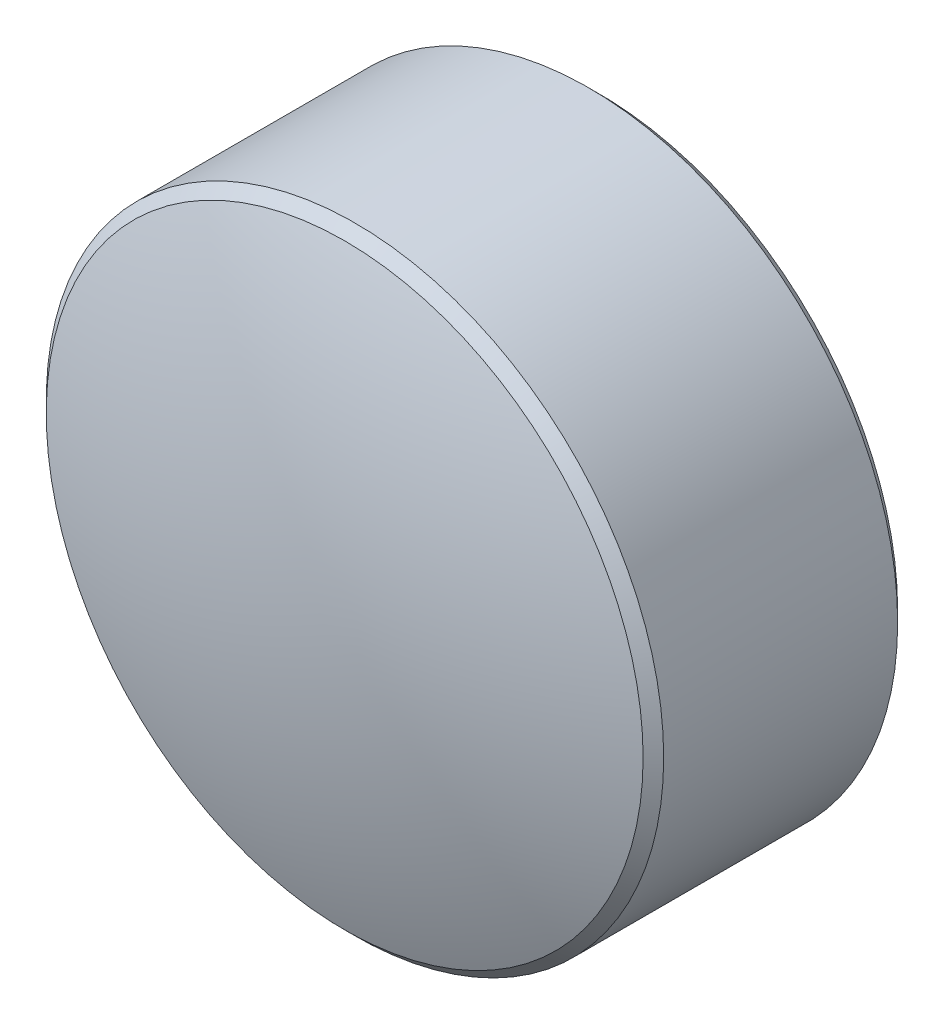
ISO-10303-21;
HEADER;
FILE_DESCRIPTION(('STEP AP214'),'2;1');
FILE_NAME('part.step','',(''),(''),'','','');
FILE_SCHEMA(('AUTOMOTIVE_DESIGN { 1 0 10303 214 1 1 1 1 }'));
ENDSEC;
DATA;
#1=APPLICATION_CONTEXT('core data for automotive mechanical design processes');
#2=APPLICATION_PROTOCOL_DEFINITION('international standard','automotive_design',2000,#1);
#3=PRODUCT_CONTEXT('',#1,'mechanical');
#4=PRODUCT('Part','Part','',(#3));
#5=PRODUCT_RELATED_PRODUCT_CATEGORY('part','',(#4));
#6=PRODUCT_DEFINITION_FORMATION('','',#4);
#7=PRODUCT_DEFINITION_CONTEXT('part definition',#1,'design');
#8=PRODUCT_DEFINITION('design','',#6,#7);
#9=PRODUCT_DEFINITION_SHAPE('','',#8);
#10=(LENGTH_UNIT() NAMED_UNIT(*) SI_UNIT(.MILLI.,.METRE.));
#11=(NAMED_UNIT(*) PLANE_ANGLE_UNIT() SI_UNIT($,.RADIAN.));
#12=(NAMED_UNIT(*) SI_UNIT($,.STERADIAN.) SOLID_ANGLE_UNIT());
#13=UNCERTAINTY_MEASURE_WITH_UNIT(LENGTH_MEASURE(1.E-05),#10,'distance_accuracy_value','');
#14=(GEOMETRIC_REPRESENTATION_CONTEXT(3) GLOBAL_UNCERTAINTY_ASSIGNED_CONTEXT((#13)) GLOBAL_UNIT_ASSIGNED_CONTEXT((#10,
#11,#12)) REPRESENTATION_CONTEXT('',''));
#15=CARTESIAN_POINT('',(0.,0.,0.));
#16=DIRECTION('',(0.,0.,1.));
#17=DIRECTION('',(1.,0.,0.));
#18=AXIS2_PLACEMENT_3D('',#15,#16,#17);
#19=CARTESIAN_POINT('',(0.293400927018407,1.73321593913016,1.87494636038061));
#20=DIRECTION('',(0.,0.,1.));
#21=DIRECTION('',(1.,0.,0.));
#22=AXIS2_PLACEMENT_3D('',#19,#20,#21);
#23=PLANE('',#22);
#24=CARTESIAN_POINT('',(0.293400927018407,1.73321593913016,1.87494636038061));
#25=DIRECTION('',(0.,0.,1.));
#26=DIRECTION('',(1.,0.,0.));
#27=AXIS2_PLACEMENT_3D('',#24,#25,#26);
#28=CIRCLE('',#27,1.45);
#29=CARTESIAN_POINT('',(1.74340092701841,1.73321593913016,1.87494636038061));
#30=VERTEX_POINT('',#29);
#31=EDGE_CURVE('E9',#30,#30,#28,.F.);
#32=ORIENTED_EDGE('',*,*,#31,.T.);
#33=EDGE_LOOP('',(#32));
#34=FACE_BOUND('',#33,.T.);
#35=ADVANCED_FACE('F13',(#34),#23,.F.);
#36=CARTESIAN_POINT('',(0.293400927018407,1.73321593913016,3.37494636038061));
#37=DIRECTION('',(0.,0.,1.));
#38=DIRECTION('',(1.,0.,0.));
#39=AXIS2_PLACEMENT_3D('',#36,#37,#38);
#40=CYLINDRICAL_SURFACE('',#39,1.5);
#41=CARTESIAN_POINT('',(0.293400927018407,1.73321593913016,1.92494636038061));
#42=DIRECTION('',(0.,0.,1.));
#43=DIRECTION('',(1.,0.,0.));
#44=AXIS2_PLACEMENT_3D('',#41,#42,#43);
#45=CIRCLE('',#44,1.5);
#46=CARTESIAN_POINT('',(1.79340092701841,1.73321593913016,1.92494636038061));
#47=VERTEX_POINT('',#46);
#48=EDGE_CURVE('E20',#47,#47,#45,.T.);
#49=ORIENTED_EDGE('',*,*,#48,.T.);
#50=EDGE_LOOP('',(#49));
#51=FACE_BOUND('',#50,.T.);
#52=CARTESIAN_POINT('',(0.293400927018407,1.73321593913016,3.06176605588803));
#53=DIRECTION('',(0.,0.,1.));
#54=DIRECTION('',(1.,0.,0.));
#55=AXIS2_PLACEMENT_3D('',#52,#53,#54);
#56=CIRCLE('',#55,1.5);
#57=CARTESIAN_POINT('',(1.79340092701841,1.73321593913016,3.06176605588803));
#58=VERTEX_POINT('',#57);
#59=EDGE_CURVE('E24',#58,#58,#56,.T.);
#60=ORIENTED_EDGE('',*,*,#59,.F.);
#61=EDGE_LOOP('',(#60));
#62=FACE_BOUND('',#61,.T.);
#63=ADVANCED_FACE('F39',(#51,#62),#40,.T.);
#64=CARTESIAN_POINT('',(0.293400927018407,1.73321593913016,3.06176605588803));
#65=DIRECTION('',(0.,0.,-1.));
#66=DIRECTION('',(-1.,0.,0.));
#67=AXIS2_PLACEMENT_3D('',#64,#65,#66);
#68=CONICAL_SURFACE('',#67,1.5,0.785398163397448);
#69=CARTESIAN_POINT('',(0.293400927018407,1.73321593913016,3.11176605588803));
#70=DIRECTION('',(0.,0.,1.));
#71=DIRECTION('',(1.,0.,0.));
#72=AXIS2_PLACEMENT_3D('',#69,#70,#71);
#73=CIRCLE('',#72,1.45);
#74=CARTESIAN_POINT('',(1.74340092701841,1.73321593913016,3.11176605588803));
#75=VERTEX_POINT('',#74);
#76=EDGE_CURVE('E28',#75,#75,#73,.T.);
#77=ORIENTED_EDGE('',*,*,#76,.F.);
#78=EDGE_LOOP('',(#77));
#79=FACE_BOUND('',#78,.T.);
#80=ORIENTED_EDGE('',*,*,#59,.T.);
#81=EDGE_LOOP('',(#80));
#82=FACE_BOUND('',#81,.T.);
#83=ADVANCED_FACE('F36',(#79,#82),#68,.T.);
#84=CARTESIAN_POINT('',(0.293400927018407,1.73321593913016,-0.751053639619387));
#85=DIRECTION('',(0.,0.,1.));
#86=DIRECTION('',(0.,1.,0.));
#87=AXIS2_PLACEMENT_3D('',#84,#85,#86);
#88=SPHERICAL_SURFACE('',#87,4.126);
#89=ORIENTED_EDGE('',*,*,#76,.T.);
#90=EDGE_LOOP('',(#89));
#91=FACE_BOUND('',#90,.T.);
#92=ADVANCED_FACE('F34',(#91),#88,.T.);
#93=CARTESIAN_POINT('',(0.293400927018407,1.73321593913016,1.92494636038061));
#94=DIRECTION('',(0.,0.,1.));
#95=DIRECTION('',(1.,0.,0.));
#96=AXIS2_PLACEMENT_3D('',#93,#94,#95);
#97=CONICAL_SURFACE('',#96,1.5,0.785398163397438);
#98=ORIENTED_EDGE('',*,*,#31,.F.);
#99=EDGE_LOOP('',(#98));
#100=FACE_BOUND('',#99,.T.);
#101=ORIENTED_EDGE('',*,*,#48,.F.);
#102=EDGE_LOOP('',(#101));
#103=FACE_BOUND('',#102,.T.);
#104=ADVANCED_FACE('F15',(#100,#103),#97,.T.);
#105=CLOSED_SHELL('',(#35,#63,#83,#92,#104));
#106=MANIFOLD_SOLID_BREP('B1',#105);
#107=ADVANCED_BREP_SHAPE_REPRESENTATION('',(#18,#106),#14);
#108=SHAPE_DEFINITION_REPRESENTATION(#9,#107);
ENDSEC;
END-ISO-10303-21;
